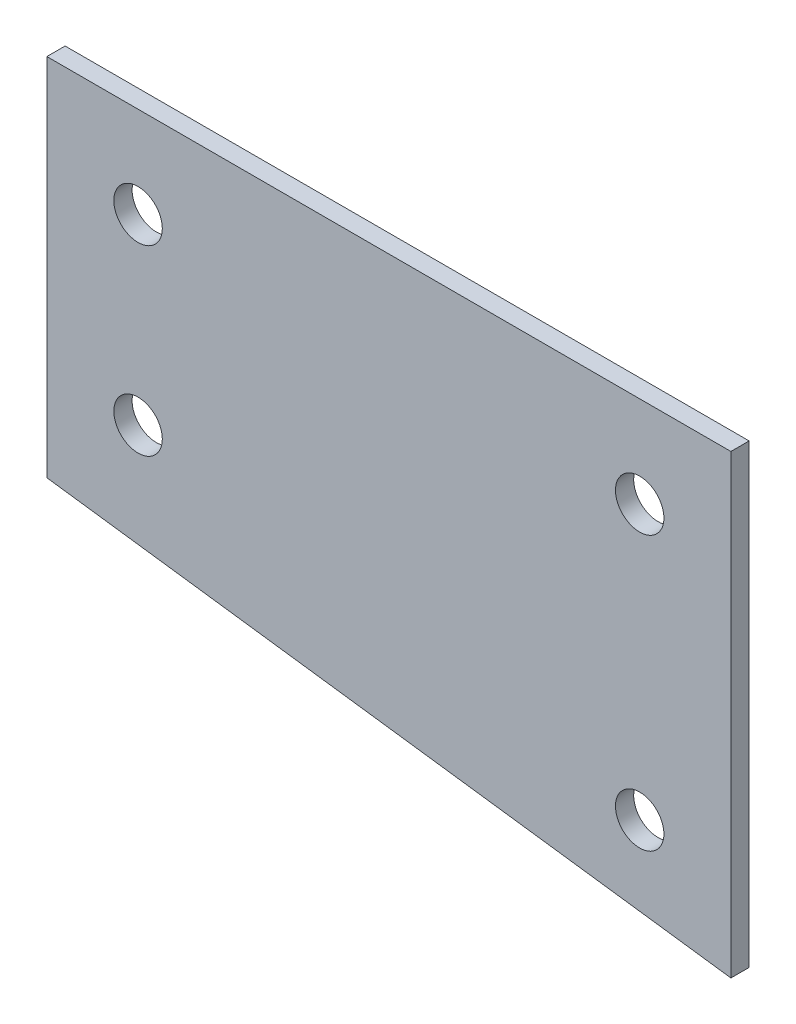
ISO-10303-21;
HEADER;
FILE_DESCRIPTION(('STEP AP214'),'2;1');
FILE_NAME('part.step','',(''),(''),'','','');
FILE_SCHEMA(('AUTOMOTIVE_DESIGN { 1 0 10303 214 1 1 1 1 }'));
ENDSEC;
DATA;
#1=APPLICATION_CONTEXT('core data for automotive mechanical design processes');
#2=APPLICATION_PROTOCOL_DEFINITION('international standard','automotive_design',2000,#1);
#3=PRODUCT_CONTEXT('',#1,'mechanical');
#4=PRODUCT('Part','Part','',(#3));
#5=PRODUCT_RELATED_PRODUCT_CATEGORY('part','',(#4));
#6=PRODUCT_DEFINITION_FORMATION('','',#4);
#7=PRODUCT_DEFINITION_CONTEXT('part definition',#1,'design');
#8=PRODUCT_DEFINITION('design','',#6,#7);
#9=PRODUCT_DEFINITION_SHAPE('','',#8);
#10=(LENGTH_UNIT() NAMED_UNIT(*) SI_UNIT(.MILLI.,.METRE.));
#11=(NAMED_UNIT(*) PLANE_ANGLE_UNIT() SI_UNIT($,.RADIAN.));
#12=(NAMED_UNIT(*) SI_UNIT($,.STERADIAN.) SOLID_ANGLE_UNIT());
#13=UNCERTAINTY_MEASURE_WITH_UNIT(LENGTH_MEASURE(1.E-05),#10,'distance_accuracy_value','');
#14=(GEOMETRIC_REPRESENTATION_CONTEXT(3) GLOBAL_UNCERTAINTY_ASSIGNED_CONTEXT((#13)) GLOBAL_UNIT_ASSIGNED_CONTEXT((#10,
#11,#12)) REPRESENTATION_CONTEXT('',''));
#15=CARTESIAN_POINT('',(0.,0.,0.));
#16=DIRECTION('',(0.,0.,1.));
#17=DIRECTION('',(1.,0.,0.));
#18=AXIS2_PLACEMENT_3D('',#15,#16,#17);
#19=CARTESIAN_POINT('',(-95.25,0.,1.27));
#20=DIRECTION('',(-1.,0.,0.));
#21=DIRECTION('',(0.,0.,1.));
#22=AXIS2_PLACEMENT_3D('',#19,#20,#21);
#23=PLANE('',#22);
#24=DIRECTION('',(0.,1.,0.));
#25=VECTOR('',#24,1.);
#26=CARTESIAN_POINT('',(-95.25,0.,-1.27));
#27=LINE('',#26,#25);
#28=CARTESIAN_POINT('',(-95.25,-25.4,-1.27));
#29=VERTEX_POINT('',#28);
#30=CARTESIAN_POINT('',(-95.25,25.4,-1.27));
#31=VERTEX_POINT('',#30);
#32=EDGE_CURVE('E86',#29,#31,#27,.T.);
#33=ORIENTED_EDGE('',*,*,#32,.F.);
#34=DIRECTION('',(0.,0.,-1.));
#35=VECTOR('',#34,1.);
#36=CARTESIAN_POINT('',(-95.25,-25.4,1.27));
#37=LINE('',#36,#35);
#38=CARTESIAN_POINT('',(-95.25,-25.4,1.27));
#39=VERTEX_POINT('',#38);
#40=EDGE_CURVE('E42',#39,#29,#37,.T.);
#41=ORIENTED_EDGE('',*,*,#40,.F.);
#42=DIRECTION('',(0.,1.,0.));
#43=VECTOR('',#42,1.);
#44=CARTESIAN_POINT('',(-95.25,0.,1.27));
#45=LINE('',#44,#43);
#46=CARTESIAN_POINT('',(-95.25,25.4,1.27));
#47=VERTEX_POINT('',#46);
#48=EDGE_CURVE('E82',#39,#47,#45,.T.);
#49=ORIENTED_EDGE('',*,*,#48,.T.);
#50=DIRECTION('',(0.,0.,-1.));
#51=VECTOR('',#50,1.);
#52=CARTESIAN_POINT('',(-95.25,25.4,1.27));
#53=LINE('',#52,#51);
#54=EDGE_CURVE('E75',#47,#31,#53,.T.);
#55=ORIENTED_EDGE('',*,*,#54,.T.);
#56=EDGE_LOOP('',(#33,#41,#49,#55));
#57=FACE_BOUND('',#56,.T.);
#58=ADVANCED_FACE('F35',(#57),#23,.T.);
#59=CARTESIAN_POINT('',(-4.99126637554585,-37.4344978165939,1.27));
#60=DIRECTION('',(-0.132163720091018,-0.991227900682635,0.));
#61=DIRECTION('',(0.991227900682635,-0.132163720091018,0.));
#62=AXIS2_PLACEMENT_3D('',#59,#60,#61);
#63=PLANE('',#62);
#64=DIRECTION('',(-0.991227900682635,0.132163720091018,0.));
#65=VECTOR('',#64,1.);
#66=CARTESIAN_POINT('',(-4.99126637554585,-37.4344978165939,-1.27));
#67=LINE('',#66,#65);
#68=CARTESIAN_POINT('',(0.,-38.1,-1.27));
#69=VERTEX_POINT('',#68);
#70=EDGE_CURVE('E81',#69,#29,#67,.T.);
#71=ORIENTED_EDGE('',*,*,#70,.F.);
#72=DIRECTION('',(0.,0.,-1.));
#73=VECTOR('',#72,1.);
#74=CARTESIAN_POINT('',(0.,-38.1,1.27));
#75=LINE('',#74,#73);
#76=CARTESIAN_POINT('',(0.,-38.1,1.27));
#77=VERTEX_POINT('',#76);
#78=EDGE_CURVE('E57',#77,#69,#75,.T.);
#79=ORIENTED_EDGE('',*,*,#78,.F.);
#80=DIRECTION('',(-0.991227900682635,0.132163720091018,0.));
#81=VECTOR('',#80,1.);
#82=CARTESIAN_POINT('',(-4.99126637554585,-37.4344978165939,1.27));
#83=LINE('',#82,#81);
#84=EDGE_CURVE('E97',#77,#39,#83,.T.);
#85=ORIENTED_EDGE('',*,*,#84,.T.);
#86=ORIENTED_EDGE('',*,*,#40,.T.);
#87=EDGE_LOOP('',(#71,#79,#85,#86));
#88=FACE_BOUND('',#87,.T.);
#89=ADVANCED_FACE('F84',(#88),#63,.T.);
#90=CARTESIAN_POINT('',(0.,0.,1.27));
#91=DIRECTION('',(-1.,0.,0.));
#92=DIRECTION('',(0.,-1.,0.));
#93=AXIS2_PLACEMENT_3D('',#90,#91,#92);
#94=PLANE('',#93);
#95=DIRECTION('',(0.,1.,0.));
#96=VECTOR('',#95,1.);
#97=CARTESIAN_POINT('',(0.,0.,-1.27));
#98=LINE('',#97,#96);
#99=CARTESIAN_POINT('',(0.,25.4,-1.27));
#100=VERTEX_POINT('',#99);
#101=EDGE_CURVE('E71',#69,#100,#98,.T.);
#102=ORIENTED_EDGE('',*,*,#101,.T.);
#103=DIRECTION('',(0.,0.,1.));
#104=VECTOR('',#103,1.);
#105=CARTESIAN_POINT('',(0.,25.4,-1.27));
#106=LINE('',#105,#104);
#107=CARTESIAN_POINT('',(0.,25.4,1.27));
#108=VERTEX_POINT('',#107);
#109=EDGE_CURVE('E49',#100,#108,#106,.T.);
#110=ORIENTED_EDGE('',*,*,#109,.T.);
#111=DIRECTION('',(0.,1.,0.));
#112=VECTOR('',#111,1.);
#113=CARTESIAN_POINT('',(0.,0.,1.27));
#114=LINE('',#113,#112);
#115=EDGE_CURVE('E73',#77,#108,#114,.T.);
#116=ORIENTED_EDGE('',*,*,#115,.F.);
#117=ORIENTED_EDGE('',*,*,#78,.T.);
#118=EDGE_LOOP('',(#102,#110,#116,#117));
#119=FACE_BOUND('',#118,.T.);
#120=ADVANCED_FACE('F70',(#119),#94,.F.);
#121=CARTESIAN_POINT('',(0.,0.,1.27));
#122=DIRECTION('',(0.,0.,1.));
#123=DIRECTION('',(1.,0.,0.));
#124=AXIS2_PLACEMENT_3D('',#121,#122,#123);
#125=PLANE('',#124);
#126=CARTESIAN_POINT('',(-82.55,12.7,1.27));
#127=DIRECTION('',(0.,0.,1.));
#128=DIRECTION('',(1.,0.,0.));
#129=AXIS2_PLACEMENT_3D('',#126,#127,#128);
#130=CIRCLE('',#129,3.37350099999999);
#131=CARTESIAN_POINT('',(-79.176499,12.7,1.27));
#132=VERTEX_POINT('',#131);
#133=EDGE_CURVE('E127',#132,#132,#130,.T.);
#134=ORIENTED_EDGE('',*,*,#133,.F.);
#135=EDGE_LOOP('',(#134));
#136=FACE_BOUND('',#135,.T.);
#137=CARTESIAN_POINT('',(-82.55,-12.7,1.27));
#138=DIRECTION('',(0.,0.,1.));
#139=DIRECTION('',(1.,0.,0.));
#140=AXIS2_PLACEMENT_3D('',#137,#138,#139);
#141=CIRCLE('',#140,3.37350099999999);
#142=CARTESIAN_POINT('',(-79.176499,-12.7,1.27));
#143=VERTEX_POINT('',#142);
#144=EDGE_CURVE('E121',#143,#143,#141,.T.);
#145=ORIENTED_EDGE('',*,*,#144,.F.);
#146=EDGE_LOOP('',(#145));
#147=FACE_BOUND('',#146,.T.);
#148=CARTESIAN_POINT('',(-12.7,-25.4,1.27));
#149=DIRECTION('',(0.,0.,1.));
#150=DIRECTION('',(1.,0.,0.));
#151=AXIS2_PLACEMENT_3D('',#148,#149,#150);
#152=CIRCLE('',#151,3.37350099999999);
#153=CARTESIAN_POINT('',(-9.32649900000002,-25.4,1.27));
#154=VERTEX_POINT('',#153);
#155=EDGE_CURVE('E115',#154,#154,#152,.T.);
#156=ORIENTED_EDGE('',*,*,#155,.F.);
#157=EDGE_LOOP('',(#156));
#158=FACE_BOUND('',#157,.T.);
#159=CARTESIAN_POINT('',(-12.7,12.7,1.27));
#160=DIRECTION('',(0.,0.,1.));
#161=DIRECTION('',(1.,0.,0.));
#162=AXIS2_PLACEMENT_3D('',#159,#160,#161);
#163=CIRCLE('',#162,3.37350099999999);
#164=CARTESIAN_POINT('',(-9.32649900000002,12.7,1.27));
#165=VERTEX_POINT('',#164);
#166=EDGE_CURVE('E109',#165,#165,#163,.T.);
#167=ORIENTED_EDGE('',*,*,#166,.F.);
#168=EDGE_LOOP('',(#167));
#169=FACE_BOUND('',#168,.T.);
#170=DIRECTION('',(1.,0.,0.));
#171=VECTOR('',#170,1.);
#172=CARTESIAN_POINT('',(0.,25.4,1.27));
#173=LINE('',#172,#171);
#174=EDGE_CURVE('E88',#47,#108,#173,.T.);
#175=ORIENTED_EDGE('',*,*,#174,.F.);
#176=ORIENTED_EDGE('',*,*,#48,.F.);
#177=ORIENTED_EDGE('',*,*,#84,.F.);
#178=ORIENTED_EDGE('',*,*,#115,.T.);
#179=EDGE_LOOP('',(#175,#176,#177,#178));
#180=FACE_BOUND('',#179,.T.);
#181=ADVANCED_FACE('F133',(#136,#147,#158,#169,#180),#125,.T.);
#182=CARTESIAN_POINT('',(0.,0.,-1.27));
#183=DIRECTION('',(0.,0.,1.));
#184=DIRECTION('',(1.,0.,0.));
#185=AXIS2_PLACEMENT_3D('',#182,#183,#184);
#186=PLANE('',#185);
#187=CARTESIAN_POINT('',(-82.55,12.7,-1.27));
#188=DIRECTION('',(0.,0.,1.));
#189=DIRECTION('',(1.,0.,0.));
#190=AXIS2_PLACEMENT_3D('',#187,#188,#189);
#191=CIRCLE('',#190,3.373501);
#192=CARTESIAN_POINT('',(-79.176499,12.7,-1.27));
#193=VERTEX_POINT('',#192);
#194=EDGE_CURVE('E124',#193,#193,#191,.T.);
#195=ORIENTED_EDGE('',*,*,#194,.T.);
#196=EDGE_LOOP('',(#195));
#197=FACE_BOUND('',#196,.T.);
#198=CARTESIAN_POINT('',(-82.55,-12.7,-1.27));
#199=DIRECTION('',(0.,0.,1.));
#200=DIRECTION('',(1.,0.,0.));
#201=AXIS2_PLACEMENT_3D('',#198,#199,#200);
#202=CIRCLE('',#201,3.373501);
#203=CARTESIAN_POINT('',(-79.176499,-12.7,-1.27));
#204=VERTEX_POINT('',#203);
#205=EDGE_CURVE('E118',#204,#204,#202,.T.);
#206=ORIENTED_EDGE('',*,*,#205,.T.);
#207=EDGE_LOOP('',(#206));
#208=FACE_BOUND('',#207,.T.);
#209=CARTESIAN_POINT('',(-12.7,-25.4,-1.27));
#210=DIRECTION('',(0.,0.,1.));
#211=DIRECTION('',(1.,0.,0.));
#212=AXIS2_PLACEMENT_3D('',#209,#210,#211);
#213=CIRCLE('',#212,3.373501);
#214=CARTESIAN_POINT('',(-9.32649900000001,-25.4,-1.27));
#215=VERTEX_POINT('',#214);
#216=EDGE_CURVE('E112',#215,#215,#213,.T.);
#217=ORIENTED_EDGE('',*,*,#216,.T.);
#218=EDGE_LOOP('',(#217));
#219=FACE_BOUND('',#218,.T.);
#220=CARTESIAN_POINT('',(-12.7,12.7,-1.27));
#221=DIRECTION('',(0.,0.,1.));
#222=DIRECTION('',(1.,0.,0.));
#223=AXIS2_PLACEMENT_3D('',#220,#221,#222);
#224=CIRCLE('',#223,3.373501);
#225=CARTESIAN_POINT('',(-9.326499,12.7,-1.27));
#226=VERTEX_POINT('',#225);
#227=EDGE_CURVE('E106',#226,#226,#224,.T.);
#228=ORIENTED_EDGE('',*,*,#227,.T.);
#229=EDGE_LOOP('',(#228));
#230=FACE_BOUND('',#229,.T.);
#231=ORIENTED_EDGE('',*,*,#32,.T.);
#232=DIRECTION('',(1.,0.,0.));
#233=VECTOR('',#232,1.);
#234=CARTESIAN_POINT('',(0.,25.4,-1.27));
#235=LINE('',#234,#233);
#236=EDGE_CURVE('E11',#31,#100,#235,.T.);
#237=ORIENTED_EDGE('',*,*,#236,.T.);
#238=ORIENTED_EDGE('',*,*,#101,.F.);
#239=ORIENTED_EDGE('',*,*,#70,.T.);
#240=EDGE_LOOP('',(#231,#237,#238,#239));
#241=FACE_BOUND('',#240,.T.);
#242=ADVANCED_FACE('F80',(#197,#208,#219,#230,#241),#186,.F.);
#243=CARTESIAN_POINT('',(0.,25.4,-1.27));
#244=DIRECTION('',(0.,-1.,0.));
#245=DIRECTION('',(0.,0.,-1.));
#246=AXIS2_PLACEMENT_3D('',#243,#244,#245);
#247=PLANE('',#246);
#248=ORIENTED_EDGE('',*,*,#174,.T.);
#249=ORIENTED_EDGE('',*,*,#109,.F.);
#250=ORIENTED_EDGE('',*,*,#236,.F.);
#251=ORIENTED_EDGE('',*,*,#54,.F.);
#252=EDGE_LOOP('',(#248,#249,#250,#251));
#253=FACE_BOUND('',#252,.T.);
#254=ADVANCED_FACE('F145',(#253),#247,.F.);
#255=CARTESIAN_POINT('',(-12.7,12.7,1.27));
#256=DIRECTION('',(0.,0.,1.));
#257=DIRECTION('',(1.,0.,0.));
#258=AXIS2_PLACEMENT_3D('',#255,#256,#257);
#259=CYLINDRICAL_SURFACE('',#258,3.37350099999999);
#260=ORIENTED_EDGE('',*,*,#227,.F.);
#261=EDGE_LOOP('',(#260));
#262=FACE_BOUND('',#261,.T.);
#263=ORIENTED_EDGE('',*,*,#166,.T.);
#264=EDGE_LOOP('',(#263));
#265=FACE_BOUND('',#264,.T.);
#266=ADVANCED_FACE('F147',(#262,#265),#259,.F.);
#267=CARTESIAN_POINT('',(-12.7,-25.4,1.27));
#268=DIRECTION('',(0.,0.,1.));
#269=DIRECTION('',(1.,0.,0.));
#270=AXIS2_PLACEMENT_3D('',#267,#268,#269);
#271=CYLINDRICAL_SURFACE('',#270,3.37350099999999);
#272=ORIENTED_EDGE('',*,*,#216,.F.);
#273=EDGE_LOOP('',(#272));
#274=FACE_BOUND('',#273,.T.);
#275=ORIENTED_EDGE('',*,*,#155,.T.);
#276=EDGE_LOOP('',(#275));
#277=FACE_BOUND('',#276,.T.);
#278=ADVANCED_FACE('F153',(#274,#277),#271,.F.);
#279=CARTESIAN_POINT('',(-82.55,-12.7,1.27));
#280=DIRECTION('',(0.,0.,1.));
#281=DIRECTION('',(1.,0.,0.));
#282=AXIS2_PLACEMENT_3D('',#279,#280,#281);
#283=CYLINDRICAL_SURFACE('',#282,3.37350099999999);
#284=ORIENTED_EDGE('',*,*,#205,.F.);
#285=EDGE_LOOP('',(#284));
#286=FACE_BOUND('',#285,.T.);
#287=ORIENTED_EDGE('',*,*,#144,.T.);
#288=EDGE_LOOP('',(#287));
#289=FACE_BOUND('',#288,.T.);
#290=ADVANCED_FACE('F193',(#286,#289),#283,.F.);
#291=CARTESIAN_POINT('',(-82.55,12.7,1.27));
#292=DIRECTION('',(0.,0.,1.));
#293=DIRECTION('',(1.,0.,0.));
#294=AXIS2_PLACEMENT_3D('',#291,#292,#293);
#295=CYLINDRICAL_SURFACE('',#294,3.37350099999999);
#296=ORIENTED_EDGE('',*,*,#194,.F.);
#297=EDGE_LOOP('',(#296));
#298=FACE_BOUND('',#297,.T.);
#299=ORIENTED_EDGE('',*,*,#133,.T.);
#300=EDGE_LOOP('',(#299));
#301=FACE_BOUND('',#300,.T.);
#302=ADVANCED_FACE('F131',(#298,#301),#295,.F.);
#303=CLOSED_SHELL('',(#58,#89,#120,#181,#242,#254,#266,#278,#290,#302));
#304=MANIFOLD_SOLID_BREP('B2',#303);
#305=ADVANCED_BREP_SHAPE_REPRESENTATION('',(#18,#304),#14);
#306=SHAPE_DEFINITION_REPRESENTATION(#9,#305);
ENDSEC;
END-ISO-10303-21;
